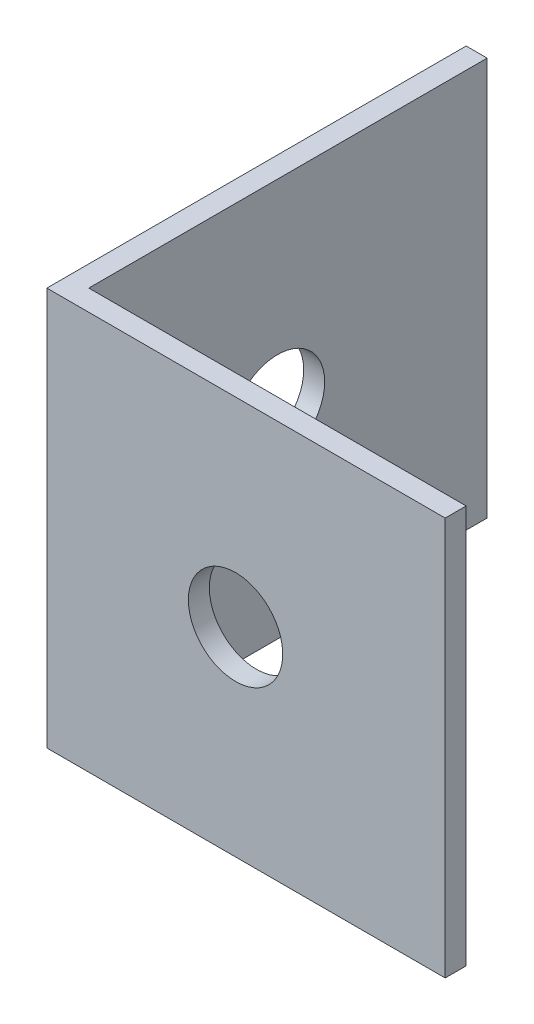
ISO-10303-21;
HEADER;
FILE_DESCRIPTION(('STEP AP214'),'2;1');
FILE_NAME('part.step','',(''),(''),'','','');
FILE_SCHEMA(('AUTOMOTIVE_DESIGN { 1 0 10303 214 1 1 1 1 }'));
ENDSEC;
DATA;
#1=APPLICATION_CONTEXT('core data for automotive mechanical design processes');
#2=APPLICATION_PROTOCOL_DEFINITION('international standard','automotive_design',2000,#1);
#3=PRODUCT_CONTEXT('',#1,'mechanical');
#4=PRODUCT('Part','Part','',(#3));
#5=PRODUCT_RELATED_PRODUCT_CATEGORY('part','',(#4));
#6=PRODUCT_DEFINITION_FORMATION('','',#4);
#7=PRODUCT_DEFINITION_CONTEXT('part definition',#1,'design');
#8=PRODUCT_DEFINITION('design','',#6,#7);
#9=PRODUCT_DEFINITION_SHAPE('','',#8);
#10=(LENGTH_UNIT() NAMED_UNIT(*) SI_UNIT(.MILLI.,.METRE.));
#11=(NAMED_UNIT(*) PLANE_ANGLE_UNIT() SI_UNIT($,.RADIAN.));
#12=(NAMED_UNIT(*) SI_UNIT($,.STERADIAN.) SOLID_ANGLE_UNIT());
#13=UNCERTAINTY_MEASURE_WITH_UNIT(LENGTH_MEASURE(1.E-05),#10,'distance_accuracy_value','');
#14=(GEOMETRIC_REPRESENTATION_CONTEXT(3) GLOBAL_UNCERTAINTY_ASSIGNED_CONTEXT((#13)) GLOBAL_UNIT_ASSIGNED_CONTEXT((#10,
#11,#12)) REPRESENTATION_CONTEXT('',''));
#15=CARTESIAN_POINT('',(0.,0.,0.));
#16=DIRECTION('',(0.,0.,1.));
#17=DIRECTION('',(1.,0.,0.));
#18=AXIS2_PLACEMENT_3D('',#15,#16,#17);
#19=CARTESIAN_POINT('',(20.,19.,0.));
#20=DIRECTION('',(0.,0.,-1.));
#21=DIRECTION('',(-1.,0.,0.));
#22=AXIS2_PLACEMENT_3D('',#19,#20,#21);
#23=PLANE('',#22);
#24=CARTESIAN_POINT('',(9.,9.5,0.));
#25=DIRECTION('',(0.,0.,-1.));
#26=DIRECTION('',(-1.,0.,0.));
#27=AXIS2_PLACEMENT_3D('',#24,#25,#26);
#28=CIRCLE('',#27,2.25);
#29=CARTESIAN_POINT('',(6.75,9.5,0.));
#30=VERTEX_POINT('',#29);
#31=EDGE_CURVE('E148',#30,#30,#28,.T.);
#32=ORIENTED_EDGE('',*,*,#31,.T.);
#33=EDGE_LOOP('',(#32));
#34=FACE_BOUND('',#33,.T.);
#35=DIRECTION('',(0.,-1.,0.));
#36=VECTOR('',#35,1.);
#37=CARTESIAN_POINT('',(19.,19.,0.));
#38=LINE('',#37,#36);
#39=CARTESIAN_POINT('',(19.,19.,0.));
#40=VERTEX_POINT('',#39);
#41=CARTESIAN_POINT('',(19.,0.,0.));
#42=VERTEX_POINT('',#41);
#43=EDGE_CURVE('E52',#40,#42,#38,.T.);
#44=ORIENTED_EDGE('',*,*,#43,.F.);
#45=DIRECTION('',(1.,0.,0.));
#46=VECTOR('',#45,1.);
#47=CARTESIAN_POINT('',(20.,19.,0.));
#48=LINE('',#47,#46);
#49=CARTESIAN_POINT('',(0.,19.,0.));
#50=VERTEX_POINT('',#49);
#51=EDGE_CURVE('E124',#50,#40,#48,.T.);
#52=ORIENTED_EDGE('',*,*,#51,.F.);
#53=DIRECTION('',(0.,-1.,0.));
#54=VECTOR('',#53,1.);
#55=CARTESIAN_POINT('',(0.,19.,0.));
#56=LINE('',#55,#54);
#57=CARTESIAN_POINT('',(0.,0.,0.));
#58=VERTEX_POINT('',#57);
#59=EDGE_CURVE('E125',#50,#58,#56,.T.);
#60=ORIENTED_EDGE('',*,*,#59,.T.);
#61=DIRECTION('',(1.,0.,0.));
#62=VECTOR('',#61,1.);
#63=CARTESIAN_POINT('',(20.,0.,0.));
#64=LINE('',#63,#62);
#65=EDGE_CURVE('E115',#58,#42,#64,.T.);
#66=ORIENTED_EDGE('',*,*,#65,.T.);
#67=EDGE_LOOP('',(#44,#52,#60,#66));
#68=FACE_BOUND('',#67,.T.);
#69=ADVANCED_FACE('F38',(#34,#68),#23,.F.);
#70=CARTESIAN_POINT('',(1.,19.,-0.999999999999997));
#71=DIRECTION('',(0.,0.,1.));
#72=DIRECTION('',(1.,0.,0.));
#73=AXIS2_PLACEMENT_3D('',#70,#71,#72);
#74=PLANE('',#73);
#75=CARTESIAN_POINT('',(9.,9.5,-0.999999999999997));
#76=DIRECTION('',(0.,0.,-1.));
#77=DIRECTION('',(-1.,0.,0.));
#78=AXIS2_PLACEMENT_3D('',#75,#76,#77);
#79=CIRCLE('',#78,2.25);
#80=CARTESIAN_POINT('',(6.75,9.5,-0.999999999999997));
#81=VERTEX_POINT('',#80);
#82=EDGE_CURVE('E149',#81,#81,#79,.T.);
#83=ORIENTED_EDGE('',*,*,#82,.F.);
#84=EDGE_LOOP('',(#83));
#85=FACE_BOUND('',#84,.T.);
#86=DIRECTION('',(0.,1.,0.));
#87=VECTOR('',#86,1.);
#88=CARTESIAN_POINT('',(19.,0.,-0.999999999999998));
#89=LINE('',#88,#87);
#90=CARTESIAN_POINT('',(19.,0.,-0.999999999999998));
#91=VERTEX_POINT('',#90);
#92=CARTESIAN_POINT('',(19.,19.,-0.999999999999998));
#93=VERTEX_POINT('',#92);
#94=EDGE_CURVE('E100',#91,#93,#89,.T.);
#95=ORIENTED_EDGE('',*,*,#94,.F.);
#96=DIRECTION('',(-1.,0.,0.));
#97=VECTOR('',#96,1.);
#98=CARTESIAN_POINT('',(1.,0.,-0.999999999999997));
#99=LINE('',#98,#97);
#100=CARTESIAN_POINT('',(1.,0.,-0.999999999999997));
#101=VERTEX_POINT('',#100);
#102=EDGE_CURVE('E108',#91,#101,#99,.T.);
#103=ORIENTED_EDGE('',*,*,#102,.T.);
#104=DIRECTION('',(0.,-1.,0.));
#105=VECTOR('',#104,1.);
#106=CARTESIAN_POINT('',(1.,19.,-0.999999999999997));
#107=LINE('',#106,#105);
#108=CARTESIAN_POINT('',(1.,19.,-0.999999999999997));
#109=VERTEX_POINT('',#108);
#110=EDGE_CURVE('E11',#109,#101,#107,.T.);
#111=ORIENTED_EDGE('',*,*,#110,.F.);
#112=DIRECTION('',(-1.,0.,0.));
#113=VECTOR('',#112,1.);
#114=CARTESIAN_POINT('',(1.,19.,-0.999999999999997));
#115=LINE('',#114,#113);
#116=EDGE_CURVE('E89',#93,#109,#115,.T.);
#117=ORIENTED_EDGE('',*,*,#116,.F.);
#118=EDGE_LOOP('',(#95,#103,#111,#117));
#119=FACE_BOUND('',#118,.T.);
#120=ADVANCED_FACE('F107',(#85,#119),#74,.F.);
#121=CARTESIAN_POINT('',(0.,19.,0.));
#122=DIRECTION('',(0.,-1.,0.));
#123=DIRECTION('',(0.,0.,-1.));
#124=AXIS2_PLACEMENT_3D('',#121,#122,#123);
#125=PLANE('',#124);
#126=DIRECTION('',(0.,0.,1.));
#127=VECTOR('',#126,1.);
#128=CARTESIAN_POINT('',(19.,19.,-0.999999999999998));
#129=LINE('',#128,#127);
#130=EDGE_CURVE('E109',#93,#40,#129,.T.);
#131=ORIENTED_EDGE('',*,*,#130,.F.);
#132=ORIENTED_EDGE('',*,*,#116,.T.);
#133=DIRECTION('',(0.,0.,-1.));
#134=VECTOR('',#133,1.);
#135=CARTESIAN_POINT('',(0.999999999999998,19.,-20.));
#136=LINE('',#135,#134);
#137=CARTESIAN_POINT('',(0.999999999999998,19.,-20.));
#138=VERTEX_POINT('',#137);
#139=EDGE_CURVE('E140',#109,#138,#136,.T.);
#140=ORIENTED_EDGE('',*,*,#139,.T.);
#141=DIRECTION('',(-1.,0.,0.));
#142=VECTOR('',#141,1.);
#143=CARTESIAN_POINT('',(0.,19.,-20.));
#144=LINE('',#143,#142);
#145=CARTESIAN_POINT('',(0.,19.,-20.));
#146=VERTEX_POINT('',#145);
#147=EDGE_CURVE('E134',#138,#146,#144,.T.);
#148=ORIENTED_EDGE('',*,*,#147,.T.);
#149=DIRECTION('',(0.,0.,1.));
#150=VECTOR('',#149,1.);
#151=CARTESIAN_POINT('',(0.,19.,0.));
#152=LINE('',#151,#150);
#153=EDGE_CURVE('E61',#146,#50,#152,.T.);
#154=ORIENTED_EDGE('',*,*,#153,.T.);
#155=ORIENTED_EDGE('',*,*,#51,.T.);
#156=EDGE_LOOP('',(#131,#132,#140,#148,#154,#155));
#157=FACE_BOUND('',#156,.T.);
#158=ADVANCED_FACE('F172',(#157),#125,.F.);
#159=CARTESIAN_POINT('',(0.,0.,0.));
#160=DIRECTION('',(0.,-1.,0.));
#161=DIRECTION('',(0.,0.,-1.));
#162=AXIS2_PLACEMENT_3D('',#159,#160,#161);
#163=PLANE('',#162);
#164=ORIENTED_EDGE('',*,*,#102,.F.);
#165=DIRECTION('',(0.,0.,-1.));
#166=VECTOR('',#165,1.);
#167=CARTESIAN_POINT('',(19.,0.,0.));
#168=LINE('',#167,#166);
#169=EDGE_CURVE('E97',#42,#91,#168,.T.);
#170=ORIENTED_EDGE('',*,*,#169,.F.);
#171=ORIENTED_EDGE('',*,*,#65,.F.);
#172=DIRECTION('',(0.,0.,1.));
#173=VECTOR('',#172,1.);
#174=CARTESIAN_POINT('',(0.,0.,0.));
#175=LINE('',#174,#173);
#176=CARTESIAN_POINT('',(0.,0.,-20.));
#177=VERTEX_POINT('',#176);
#178=EDGE_CURVE('E82',#177,#58,#175,.T.);
#179=ORIENTED_EDGE('',*,*,#178,.F.);
#180=DIRECTION('',(-1.,0.,0.));
#181=VECTOR('',#180,1.);
#182=CARTESIAN_POINT('',(0.,0.,-20.));
#183=LINE('',#182,#181);
#184=CARTESIAN_POINT('',(0.999999999999998,0.,-20.));
#185=VERTEX_POINT('',#184);
#186=EDGE_CURVE('E117',#185,#177,#183,.T.);
#187=ORIENTED_EDGE('',*,*,#186,.F.);
#188=DIRECTION('',(0.,0.,-1.));
#189=VECTOR('',#188,1.);
#190=CARTESIAN_POINT('',(0.999999999999998,0.,-20.));
#191=LINE('',#190,#189);
#192=EDGE_CURVE('E114',#101,#185,#191,.T.);
#193=ORIENTED_EDGE('',*,*,#192,.F.);
#194=EDGE_LOOP('',(#164,#170,#171,#179,#187,#193));
#195=FACE_BOUND('',#194,.T.);
#196=ADVANCED_FACE('F112',(#195),#163,.T.);
#197=CARTESIAN_POINT('',(0.999999999999998,19.,-20.));
#198=DIRECTION('',(-1.,0.,0.));
#199=DIRECTION('',(0.,0.,1.));
#200=AXIS2_PLACEMENT_3D('',#197,#198,#199);
#201=PLANE('',#200);
#202=CARTESIAN_POINT('',(0.999999999999999,9.5,-10.));
#203=DIRECTION('',(1.,0.,0.));
#204=DIRECTION('',(0.,0.,-1.));
#205=AXIS2_PLACEMENT_3D('',#202,#203,#204);
#206=CIRCLE('',#205,2.25);
#207=CARTESIAN_POINT('',(0.999999999999999,9.5,-12.25));
#208=VERTEX_POINT('',#207);
#209=EDGE_CURVE('E155',#208,#208,#206,.T.);
#210=ORIENTED_EDGE('',*,*,#209,.F.);
#211=EDGE_LOOP('',(#210));
#212=FACE_BOUND('',#211,.T.);
#213=ORIENTED_EDGE('',*,*,#192,.T.);
#214=DIRECTION('',(0.,-1.,0.));
#215=VECTOR('',#214,1.);
#216=CARTESIAN_POINT('',(0.999999999999998,19.,-20.));
#217=LINE('',#216,#215);
#218=EDGE_CURVE('E45',#138,#185,#217,.T.);
#219=ORIENTED_EDGE('',*,*,#218,.F.);
#220=ORIENTED_EDGE('',*,*,#139,.F.);
#221=ORIENTED_EDGE('',*,*,#110,.T.);
#222=EDGE_LOOP('',(#213,#219,#220,#221));
#223=FACE_BOUND('',#222,.T.);
#224=ADVANCED_FACE('F169',(#212,#223),#201,.F.);
#225=CARTESIAN_POINT('',(0.,19.,-20.));
#226=DIRECTION('',(0.,0.,1.));
#227=DIRECTION('',(1.,0.,0.));
#228=AXIS2_PLACEMENT_3D('',#225,#226,#227);
#229=PLANE('',#228);
#230=ORIENTED_EDGE('',*,*,#186,.T.);
#231=DIRECTION('',(0.,-1.,0.));
#232=VECTOR('',#231,1.);
#233=CARTESIAN_POINT('',(0.,19.,-20.));
#234=LINE('',#233,#232);
#235=EDGE_CURVE('E127',#146,#177,#234,.T.);
#236=ORIENTED_EDGE('',*,*,#235,.F.);
#237=ORIENTED_EDGE('',*,*,#147,.F.);
#238=ORIENTED_EDGE('',*,*,#218,.T.);
#239=EDGE_LOOP('',(#230,#236,#237,#238));
#240=FACE_BOUND('',#239,.T.);
#241=ADVANCED_FACE('F132',(#240),#229,.F.);
#242=CARTESIAN_POINT('',(0.,19.,0.));
#243=DIRECTION('',(1.,0.,0.));
#244=DIRECTION('',(0.,0.,-1.));
#245=AXIS2_PLACEMENT_3D('',#242,#243,#244);
#246=PLANE('',#245);
#247=CARTESIAN_POINT('',(0.,9.5,-10.));
#248=DIRECTION('',(1.,0.,0.));
#249=DIRECTION('',(0.,0.,-1.));
#250=AXIS2_PLACEMENT_3D('',#247,#248,#249);
#251=CIRCLE('',#250,2.25);
#252=CARTESIAN_POINT('',(0.,9.5,-12.25));
#253=VERTEX_POINT('',#252);
#254=EDGE_CURVE('E152',#253,#253,#251,.T.);
#255=ORIENTED_EDGE('',*,*,#254,.T.);
#256=EDGE_LOOP('',(#255));
#257=FACE_BOUND('',#256,.T.);
#258=ORIENTED_EDGE('',*,*,#178,.T.);
#259=ORIENTED_EDGE('',*,*,#59,.F.);
#260=ORIENTED_EDGE('',*,*,#153,.F.);
#261=ORIENTED_EDGE('',*,*,#235,.T.);
#262=EDGE_LOOP('',(#258,#259,#260,#261));
#263=FACE_BOUND('',#262,.T.);
#264=ADVANCED_FACE('F139',(#257,#263),#246,.F.);
#265=CARTESIAN_POINT('',(19.,0.,0.));
#266=DIRECTION('',(1.,0.,0.));
#267=DIRECTION('',(0.,0.,-1.));
#268=AXIS2_PLACEMENT_3D('',#265,#266,#267);
#269=PLANE('',#268);
#270=ORIENTED_EDGE('',*,*,#43,.T.);
#271=ORIENTED_EDGE('',*,*,#169,.T.);
#272=ORIENTED_EDGE('',*,*,#94,.T.);
#273=ORIENTED_EDGE('',*,*,#130,.T.);
#274=EDGE_LOOP('',(#270,#271,#272,#273));
#275=FACE_BOUND('',#274,.T.);
#276=ADVANCED_FACE('F99',(#275),#269,.T.);
#277=CARTESIAN_POINT('',(9.,9.5,0.));
#278=DIRECTION('',(0.,0.,-1.));
#279=DIRECTION('',(-1.,0.,0.));
#280=AXIS2_PLACEMENT_3D('',#277,#278,#279);
#281=CYLINDRICAL_SURFACE('',#280,2.25);
#282=ORIENTED_EDGE('',*,*,#31,.F.);
#283=EDGE_LOOP('',(#282));
#284=FACE_BOUND('',#283,.T.);
#285=ORIENTED_EDGE('',*,*,#82,.T.);
#286=EDGE_LOOP('',(#285));
#287=FACE_BOUND('',#286,.T.);
#288=ADVANCED_FACE('F165',(#284,#287),#281,.F.);
#289=CARTESIAN_POINT('',(0.,9.5,-10.));
#290=DIRECTION('',(1.,0.,0.));
#291=DIRECTION('',(0.,0.,-1.));
#292=AXIS2_PLACEMENT_3D('',#289,#290,#291);
#293=CYLINDRICAL_SURFACE('',#292,2.25);
#294=ORIENTED_EDGE('',*,*,#254,.F.);
#295=EDGE_LOOP('',(#294));
#296=FACE_BOUND('',#295,.T.);
#297=ORIENTED_EDGE('',*,*,#209,.T.);
#298=EDGE_LOOP('',(#297));
#299=FACE_BOUND('',#298,.T.);
#300=ADVANCED_FACE('F162',(#296,#299),#293,.F.);
#301=CLOSED_SHELL('',(#69,#120,#158,#196,#224,#241,#264,#276,#288,#300));
#302=MANIFOLD_SOLID_BREP('B2',#301);
#303=ADVANCED_BREP_SHAPE_REPRESENTATION('',(#18,#302),#14);
#304=SHAPE_DEFINITION_REPRESENTATION(#9,#303);
ENDSEC;
END-ISO-10303-21;
